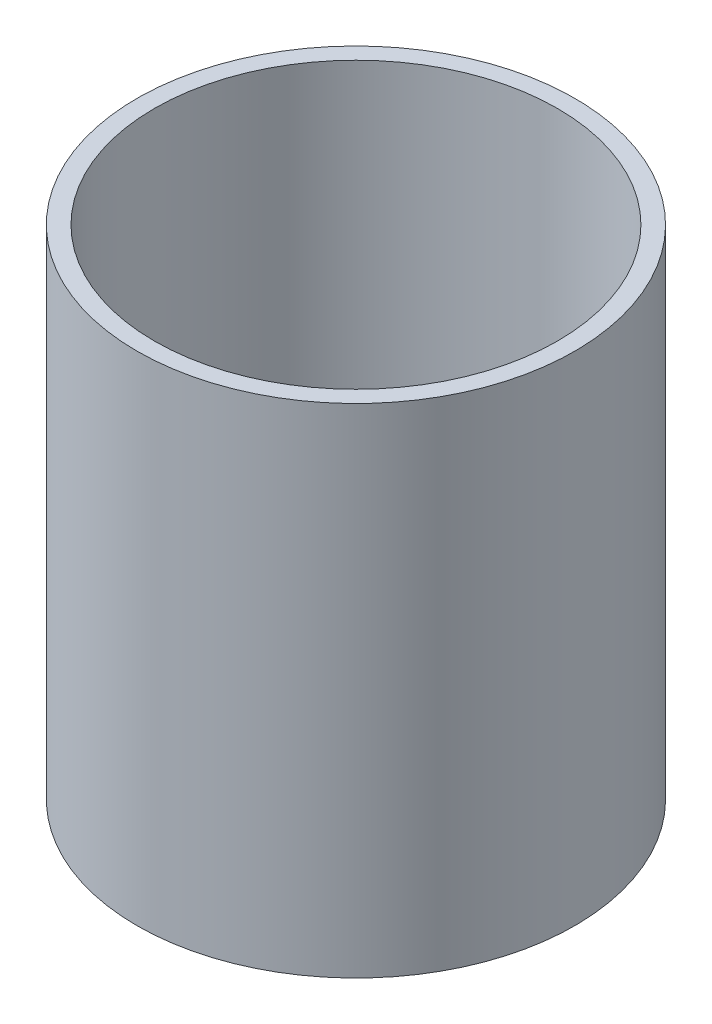
ISO-10303-21;
HEADER;
FILE_DESCRIPTION(('STEP AP214'),'2;1');
FILE_NAME('part.step','',(''),(''),'','','');
FILE_SCHEMA(('AUTOMOTIVE_DESIGN { 1 0 10303 214 1 1 1 1 }'));
ENDSEC;
DATA;
#1=APPLICATION_CONTEXT('core data for automotive mechanical design processes');
#2=APPLICATION_PROTOCOL_DEFINITION('international standard','automotive_design',2000,#1);
#3=PRODUCT_CONTEXT('',#1,'mechanical');
#4=PRODUCT('Part','Part','',(#3));
#5=PRODUCT_RELATED_PRODUCT_CATEGORY('part','',(#4));
#6=PRODUCT_DEFINITION_FORMATION('','',#4);
#7=PRODUCT_DEFINITION_CONTEXT('part definition',#1,'design');
#8=PRODUCT_DEFINITION('design','',#6,#7);
#9=PRODUCT_DEFINITION_SHAPE('','',#8);
#10=(LENGTH_UNIT() NAMED_UNIT(*) SI_UNIT(.MILLI.,.METRE.));
#11=(NAMED_UNIT(*) PLANE_ANGLE_UNIT() SI_UNIT($,.RADIAN.));
#12=(NAMED_UNIT(*) SI_UNIT($,.STERADIAN.) SOLID_ANGLE_UNIT());
#13=UNCERTAINTY_MEASURE_WITH_UNIT(LENGTH_MEASURE(1.E-05),#10,'distance_accuracy_value','');
#14=(GEOMETRIC_REPRESENTATION_CONTEXT(3) GLOBAL_UNCERTAINTY_ASSIGNED_CONTEXT((#13)) GLOBAL_UNIT_ASSIGNED_CONTEXT((#10,
#11,#12)) REPRESENTATION_CONTEXT('',''));
#15=CARTESIAN_POINT('',(0.,0.,0.));
#16=DIRECTION('',(0.,0.,1.));
#17=DIRECTION('',(1.,0.,0.));
#18=AXIS2_PLACEMENT_3D('',#15,#16,#17);
#19=CARTESIAN_POINT('',(0.,50.,0.));
#20=DIRECTION('',(0.,1.,0.));
#21=DIRECTION('',(0.,0.,1.));
#22=AXIS2_PLACEMENT_3D('',#19,#20,#21);
#23=PLANE('',#22);
#24=CARTESIAN_POINT('',(0.,50.,0.));
#25=DIRECTION('',(0.,1.,0.));
#26=DIRECTION('',(0.,0.,1.));
#27=AXIS2_PLACEMENT_3D('',#24,#25,#26);
#28=CIRCLE('',#27,22.);
#29=CARTESIAN_POINT('',(0.,50.,22.));
#30=VERTEX_POINT('',#29);
#31=EDGE_CURVE('E10',#30,#30,#28,.T.);
#32=ORIENTED_EDGE('',*,*,#31,.T.);
#33=EDGE_LOOP('',(#32));
#34=FACE_BOUND('',#33,.T.);
#35=CARTESIAN_POINT('',(0.,50.,0.));
#36=DIRECTION('',(0.,1.,0.));
#37=DIRECTION('',(0.,0.,1.));
#38=AXIS2_PLACEMENT_3D('',#35,#36,#37);
#39=CIRCLE('',#38,20.25);
#40=CARTESIAN_POINT('',(0.,50.,20.25));
#41=VERTEX_POINT('',#40);
#42=EDGE_CURVE('E41',#41,#41,#39,.T.);
#43=ORIENTED_EDGE('',*,*,#42,.F.);
#44=EDGE_LOOP('',(#43));
#45=FACE_BOUND('',#44,.T.);
#46=ADVANCED_FACE('F30',(#34,#45),#23,.T.);
#47=CARTESIAN_POINT('',(0.,0.,0.));
#48=DIRECTION('',(0.,1.,0.));
#49=DIRECTION('',(0.,0.,1.));
#50=AXIS2_PLACEMENT_3D('',#47,#48,#49);
#51=PLANE('',#50);
#52=CARTESIAN_POINT('',(0.,0.,0.));
#53=DIRECTION('',(0.,1.,0.));
#54=DIRECTION('',(0.,0.,1.));
#55=AXIS2_PLACEMENT_3D('',#52,#53,#54);
#56=CIRCLE('',#55,22.);
#57=CARTESIAN_POINT('',(0.,0.,22.));
#58=VERTEX_POINT('',#57);
#59=EDGE_CURVE('E34',#58,#58,#56,.T.);
#60=ORIENTED_EDGE('',*,*,#59,.F.);
#61=EDGE_LOOP('',(#60));
#62=FACE_BOUND('',#61,.T.);
#63=CARTESIAN_POINT('',(0.,0.,0.));
#64=DIRECTION('',(0.,1.,0.));
#65=DIRECTION('',(0.,0.,1.));
#66=AXIS2_PLACEMENT_3D('',#63,#64,#65);
#67=CIRCLE('',#66,20.25);
#68=CARTESIAN_POINT('',(0.,0.,20.25));
#69=VERTEX_POINT('',#68);
#70=EDGE_CURVE('E43',#69,#69,#67,.T.);
#71=ORIENTED_EDGE('',*,*,#70,.T.);
#72=EDGE_LOOP('',(#71));
#73=FACE_BOUND('',#72,.T.);
#74=ADVANCED_FACE('F53',(#62,#73),#51,.F.);
#75=CARTESIAN_POINT('',(0.,50.,0.));
#76=DIRECTION('',(0.,-1.,0.));
#77=DIRECTION('',(0.,0.,-1.));
#78=AXIS2_PLACEMENT_3D('',#75,#76,#77);
#79=CYLINDRICAL_SURFACE('',#78,22.);
#80=ORIENTED_EDGE('',*,*,#31,.F.);
#81=EDGE_LOOP('',(#80));
#82=FACE_BOUND('',#81,.T.);
#83=ORIENTED_EDGE('',*,*,#59,.T.);
#84=EDGE_LOOP('',(#83));
#85=FACE_BOUND('',#84,.T.);
#86=ADVANCED_FACE('F32',(#82,#85),#79,.T.);
#87=CARTESIAN_POINT('',(0.,50.,0.));
#88=DIRECTION('',(0.,-1.,0.));
#89=DIRECTION('',(0.,0.,-1.));
#90=AXIS2_PLACEMENT_3D('',#87,#88,#89);
#91=CYLINDRICAL_SURFACE('',#90,20.25);
#92=ORIENTED_EDGE('',*,*,#42,.T.);
#93=EDGE_LOOP('',(#92));
#94=FACE_BOUND('',#93,.T.);
#95=ORIENTED_EDGE('',*,*,#70,.F.);
#96=EDGE_LOOP('',(#95));
#97=FACE_BOUND('',#96,.T.);
#98=ADVANCED_FACE('F49',(#94,#97),#91,.F.);
#99=CLOSED_SHELL('',(#46,#74,#86,#98));
#100=MANIFOLD_SOLID_BREP('B2',#99);
#101=ADVANCED_BREP_SHAPE_REPRESENTATION('',(#18,#100),#14);
#102=SHAPE_DEFINITION_REPRESENTATION(#9,#101);
ENDSEC;
END-ISO-10303-21;
